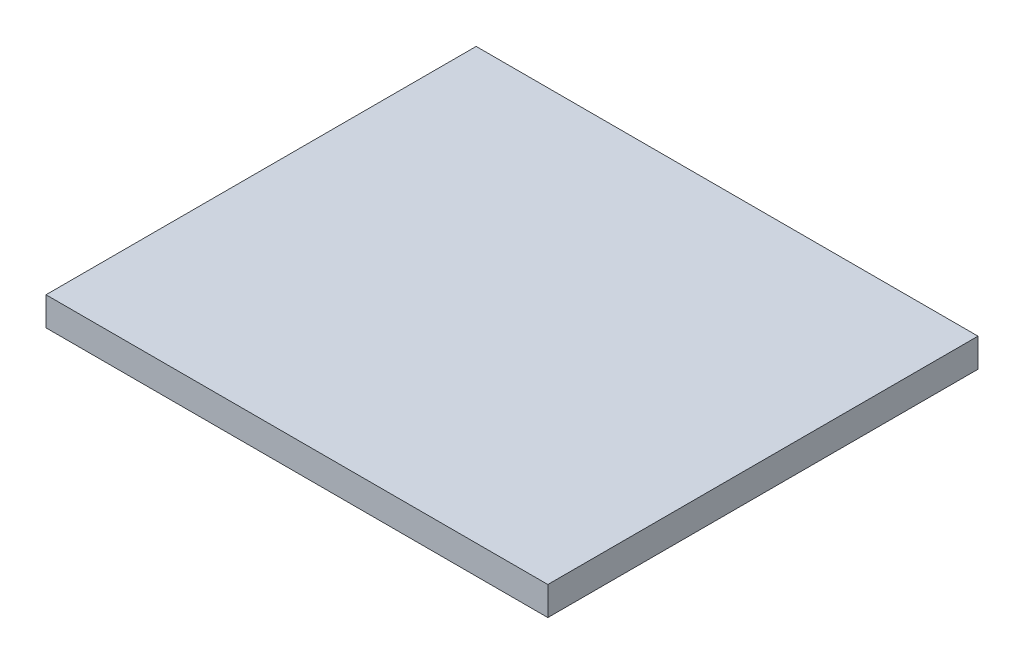
ISO-10303-21;
HEADER;
FILE_DESCRIPTION(('STEP AP214'),'2;1');
FILE_NAME('part.step','',(''),(''),'','','');
FILE_SCHEMA(('AUTOMOTIVE_DESIGN { 1 0 10303 214 1 1 1 1 }'));
ENDSEC;
DATA;
#1=APPLICATION_CONTEXT('core data for automotive mechanical design processes');
#2=APPLICATION_PROTOCOL_DEFINITION('international standard','automotive_design',2000,#1);
#3=PRODUCT_CONTEXT('',#1,'mechanical');
#4=PRODUCT('Part','Part','',(#3));
#5=PRODUCT_RELATED_PRODUCT_CATEGORY('part','',(#4));
#6=PRODUCT_DEFINITION_FORMATION('','',#4);
#7=PRODUCT_DEFINITION_CONTEXT('part definition',#1,'design');
#8=PRODUCT_DEFINITION('design','',#6,#7);
#9=PRODUCT_DEFINITION_SHAPE('','',#8);
#10=(LENGTH_UNIT() NAMED_UNIT(*) SI_UNIT(.MILLI.,.METRE.));
#11=(NAMED_UNIT(*) PLANE_ANGLE_UNIT() SI_UNIT($,.RADIAN.));
#12=(NAMED_UNIT(*) SI_UNIT($,.STERADIAN.) SOLID_ANGLE_UNIT());
#13=UNCERTAINTY_MEASURE_WITH_UNIT(LENGTH_MEASURE(1.E-05),#10,'distance_accuracy_value','');
#14=(GEOMETRIC_REPRESENTATION_CONTEXT(3) GLOBAL_UNCERTAINTY_ASSIGNED_CONTEXT((#13)) GLOBAL_UNIT_ASSIGNED_CONTEXT((#10,
#11,#12)) REPRESENTATION_CONTEXT('',''));
#15=CARTESIAN_POINT('',(0.,0.,0.));
#16=DIRECTION('',(0.,0.,1.));
#17=DIRECTION('',(1.,0.,0.));
#18=AXIS2_PLACEMENT_3D('',#15,#16,#17);
#19=CARTESIAN_POINT('',(0.,20.,0.));
#20=DIRECTION('',(-1.,0.,0.));
#21=DIRECTION('',(0.,0.,1.));
#22=AXIS2_PLACEMENT_3D('',#19,#20,#21);
#23=PLANE('',#22);
#24=DIRECTION('',(0.,0.,-1.));
#25=VECTOR('',#24,1.);
#26=CARTESIAN_POINT('',(0.,0.,0.));
#27=LINE('',#26,#25);
#28=CARTESIAN_POINT('',(0.,0.,0.));
#29=VERTEX_POINT('',#28);
#30=CARTESIAN_POINT('',(0.,0.,-300.));
#31=VERTEX_POINT('',#30);
#32=EDGE_CURVE('E107',#29,#31,#27,.T.);
#33=ORIENTED_EDGE('',*,*,#32,.T.);
#34=DIRECTION('',(0.,-1.,0.));
#35=VECTOR('',#34,1.);
#36=CARTESIAN_POINT('',(0.,20.,-300.));
#37=LINE('',#36,#35);
#38=CARTESIAN_POINT('',(0.,20.,-300.));
#39=VERTEX_POINT('',#38);
#40=EDGE_CURVE('E11',#39,#31,#37,.T.);
#41=ORIENTED_EDGE('',*,*,#40,.F.);
#42=DIRECTION('',(0.,0.,-1.));
#43=VECTOR('',#42,1.);
#44=CARTESIAN_POINT('',(0.,20.,0.));
#45=LINE('',#44,#43);
#46=CARTESIAN_POINT('',(0.,20.,0.));
#47=VERTEX_POINT('',#46);
#48=EDGE_CURVE('E91',#47,#39,#45,.T.);
#49=ORIENTED_EDGE('',*,*,#48,.F.);
#50=DIRECTION('',(0.,-1.,0.));
#51=VECTOR('',#50,1.);
#52=CARTESIAN_POINT('',(0.,20.,0.));
#53=LINE('',#52,#51);
#54=EDGE_CURVE('E103',#47,#29,#53,.T.);
#55=ORIENTED_EDGE('',*,*,#54,.T.);
#56=EDGE_LOOP('',(#33,#41,#49,#55));
#57=FACE_BOUND('',#56,.T.);
#58=ADVANCED_FACE('F39',(#57),#23,.F.);
#59=CARTESIAN_POINT('',(0.,20.,-300.));
#60=DIRECTION('',(0.,0.,1.));
#61=DIRECTION('',(1.,0.,0.));
#62=AXIS2_PLACEMENT_3D('',#59,#60,#61);
#63=PLANE('',#62);
#64=DIRECTION('',(-1.,0.,0.));
#65=VECTOR('',#64,1.);
#66=CARTESIAN_POINT('',(0.,0.,-300.));
#67=LINE('',#66,#65);
#68=CARTESIAN_POINT('',(-350.,0.,-300.));
#69=VERTEX_POINT('',#68);
#70=EDGE_CURVE('E96',#31,#69,#67,.T.);
#71=ORIENTED_EDGE('',*,*,#70,.T.);
#72=DIRECTION('',(0.,-1.,0.));
#73=VECTOR('',#72,1.);
#74=CARTESIAN_POINT('',(-350.,20.,-300.));
#75=LINE('',#74,#73);
#76=CARTESIAN_POINT('',(-350.,20.,-300.));
#77=VERTEX_POINT('',#76);
#78=EDGE_CURVE('E48',#77,#69,#75,.T.);
#79=ORIENTED_EDGE('',*,*,#78,.F.);
#80=DIRECTION('',(-1.,0.,0.));
#81=VECTOR('',#80,1.);
#82=CARTESIAN_POINT('',(0.,20.,-300.));
#83=LINE('',#82,#81);
#84=EDGE_CURVE('E86',#39,#77,#83,.T.);
#85=ORIENTED_EDGE('',*,*,#84,.F.);
#86=ORIENTED_EDGE('',*,*,#40,.T.);
#87=EDGE_LOOP('',(#71,#79,#85,#86));
#88=FACE_BOUND('',#87,.T.);
#89=ADVANCED_FACE('F95',(#88),#63,.F.);
#90=CARTESIAN_POINT('',(-350.,20.,0.));
#91=DIRECTION('',(1.,0.,0.));
#92=DIRECTION('',(0.,0.,-1.));
#93=AXIS2_PLACEMENT_3D('',#90,#91,#92);
#94=PLANE('',#93);
#95=DIRECTION('',(0.,0.,1.));
#96=VECTOR('',#95,1.);
#97=CARTESIAN_POINT('',(-350.,0.,0.));
#98=LINE('',#97,#96);
#99=CARTESIAN_POINT('',(-350.,0.,0.));
#100=VERTEX_POINT('',#99);
#101=EDGE_CURVE('E73',#69,#100,#98,.T.);
#102=ORIENTED_EDGE('',*,*,#101,.T.);
#103=DIRECTION('',(0.,-1.,0.));
#104=VECTOR('',#103,1.);
#105=CARTESIAN_POINT('',(-350.,20.,0.));
#106=LINE('',#105,#104);
#107=CARTESIAN_POINT('',(-350.,20.,0.));
#108=VERTEX_POINT('',#107);
#109=EDGE_CURVE('E98',#108,#100,#106,.T.);
#110=ORIENTED_EDGE('',*,*,#109,.F.);
#111=DIRECTION('',(0.,0.,1.));
#112=VECTOR('',#111,1.);
#113=CARTESIAN_POINT('',(-350.,20.,0.));
#114=LINE('',#113,#112);
#115=EDGE_CURVE('E89',#77,#108,#114,.T.);
#116=ORIENTED_EDGE('',*,*,#115,.F.);
#117=ORIENTED_EDGE('',*,*,#78,.T.);
#118=EDGE_LOOP('',(#102,#110,#116,#117));
#119=FACE_BOUND('',#118,.T.);
#120=ADVANCED_FACE('F99',(#119),#94,.F.);
#121=CARTESIAN_POINT('',(0.,20.,0.));
#122=DIRECTION('',(0.,0.,-1.));
#123=DIRECTION('',(-1.,0.,0.));
#124=AXIS2_PLACEMENT_3D('',#121,#122,#123);
#125=PLANE('',#124);
#126=DIRECTION('',(1.,0.,0.));
#127=VECTOR('',#126,1.);
#128=CARTESIAN_POINT('',(0.,0.,0.));
#129=LINE('',#128,#127);
#130=EDGE_CURVE('E79',#100,#29,#129,.T.);
#131=ORIENTED_EDGE('',*,*,#130,.T.);
#132=ORIENTED_EDGE('',*,*,#54,.F.);
#133=DIRECTION('',(1.,0.,0.));
#134=VECTOR('',#133,1.);
#135=CARTESIAN_POINT('',(0.,20.,0.));
#136=LINE('',#135,#134);
#137=EDGE_CURVE('E56',#108,#47,#136,.T.);
#138=ORIENTED_EDGE('',*,*,#137,.F.);
#139=ORIENTED_EDGE('',*,*,#109,.T.);
#140=EDGE_LOOP('',(#131,#132,#138,#139));
#141=FACE_BOUND('',#140,.T.);
#142=ADVANCED_FACE('F120',(#141),#125,.F.);
#143=CARTESIAN_POINT('',(0.,20.,0.));
#144=DIRECTION('',(0.,1.,0.));
#145=DIRECTION('',(0.,0.,1.));
#146=AXIS2_PLACEMENT_3D('',#143,#144,#145);
#147=PLANE('',#146);
#148=ORIENTED_EDGE('',*,*,#48,.T.);
#149=ORIENTED_EDGE('',*,*,#84,.T.);
#150=ORIENTED_EDGE('',*,*,#115,.T.);
#151=ORIENTED_EDGE('',*,*,#137,.T.);
#152=EDGE_LOOP('',(#148,#149,#150,#151));
#153=FACE_BOUND('',#152,.T.);
#154=ADVANCED_FACE('F87',(#153),#147,.T.);
#155=CARTESIAN_POINT('',(0.,0.,0.));
#156=DIRECTION('',(0.,1.,0.));
#157=DIRECTION('',(0.,0.,1.));
#158=AXIS2_PLACEMENT_3D('',#155,#156,#157);
#159=PLANE('',#158);
#160=ORIENTED_EDGE('',*,*,#32,.F.);
#161=ORIENTED_EDGE('',*,*,#130,.F.);
#162=ORIENTED_EDGE('',*,*,#101,.F.);
#163=ORIENTED_EDGE('',*,*,#70,.F.);
#164=EDGE_LOOP('',(#160,#161,#162,#163));
#165=FACE_BOUND('',#164,.T.);
#166=ADVANCED_FACE('F123',(#165),#159,.F.);
#167=CLOSED_SHELL('',(#58,#89,#120,#142,#154,#166));
#168=MANIFOLD_SOLID_BREP('B2',#167);
#169=ADVANCED_BREP_SHAPE_REPRESENTATION('',(#18,#168),#14);
#170=SHAPE_DEFINITION_REPRESENTATION(#9,#169);
ENDSEC;
END-ISO-10303-21;
